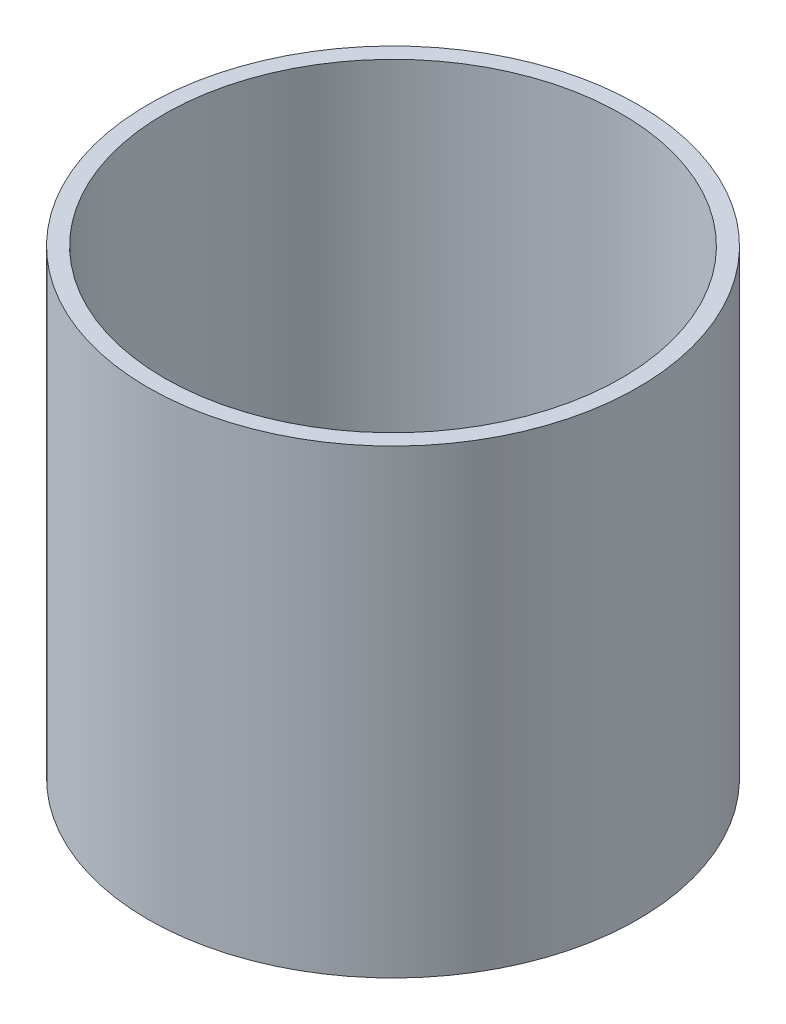
ISO-10303-21;
HEADER;
FILE_DESCRIPTION(('STEP AP214'),'2;1');
FILE_NAME('part.step','',(''),(''),'','','');
FILE_SCHEMA(('AUTOMOTIVE_DESIGN { 1 0 10303 214 1 1 1 1 }'));
ENDSEC;
DATA;
#1=APPLICATION_CONTEXT('core data for automotive mechanical design processes');
#2=APPLICATION_PROTOCOL_DEFINITION('international standard','automotive_design',2000,#1);
#3=PRODUCT_CONTEXT('',#1,'mechanical');
#4=PRODUCT('Part','Part','',(#3));
#5=PRODUCT_RELATED_PRODUCT_CATEGORY('part','',(#4));
#6=PRODUCT_DEFINITION_FORMATION('','',#4);
#7=PRODUCT_DEFINITION_CONTEXT('part definition',#1,'design');
#8=PRODUCT_DEFINITION('design','',#6,#7);
#9=PRODUCT_DEFINITION_SHAPE('','',#8);
#10=(LENGTH_UNIT() NAMED_UNIT(*) SI_UNIT(.MILLI.,.METRE.));
#11=(NAMED_UNIT(*) PLANE_ANGLE_UNIT() SI_UNIT($,.RADIAN.));
#12=(NAMED_UNIT(*) SI_UNIT($,.STERADIAN.) SOLID_ANGLE_UNIT());
#13=UNCERTAINTY_MEASURE_WITH_UNIT(LENGTH_MEASURE(1.E-05),#10,'distance_accuracy_value','');
#14=(GEOMETRIC_REPRESENTATION_CONTEXT(3) GLOBAL_UNCERTAINTY_ASSIGNED_CONTEXT((#13)) GLOBAL_UNIT_ASSIGNED_CONTEXT((#10,
#11,#12)) REPRESENTATION_CONTEXT('',''));
#15=CARTESIAN_POINT('',(0.,0.,0.));
#16=DIRECTION('',(0.,0.,1.));
#17=DIRECTION('',(1.,0.,0.));
#18=AXIS2_PLACEMENT_3D('',#15,#16,#17);
#19=CARTESIAN_POINT('',(0.,282.,0.));
#20=DIRECTION('',(0.,-1.,0.));
#21=DIRECTION('',(0.,0.,-1.));
#22=AXIS2_PLACEMENT_3D('',#19,#20,#21);
#23=CYLINDRICAL_SURFACE('',#22,150.);
#24=CARTESIAN_POINT('',(0.,282.,0.));
#25=DIRECTION('',(0.,1.,0.));
#26=DIRECTION('',(0.,0.,1.));
#27=AXIS2_PLACEMENT_3D('',#24,#25,#26);
#28=CIRCLE('',#27,150.);
#29=CARTESIAN_POINT('',(0.,282.,150.));
#30=VERTEX_POINT('',#29);
#31=EDGE_CURVE('E40',#30,#30,#28,.T.);
#32=ORIENTED_EDGE('',*,*,#31,.F.);
#33=EDGE_LOOP('',(#32));
#34=FACE_BOUND('',#33,.T.);
#35=CARTESIAN_POINT('',(0.,0.,0.));
#36=DIRECTION('',(0.,1.,0.));
#37=DIRECTION('',(0.,0.,1.));
#38=AXIS2_PLACEMENT_3D('',#35,#36,#37);
#39=CIRCLE('',#38,150.);
#40=CARTESIAN_POINT('',(0.,0.,150.));
#41=VERTEX_POINT('',#40);
#42=EDGE_CURVE('E46',#41,#41,#39,.T.);
#43=ORIENTED_EDGE('',*,*,#42,.T.);
#44=EDGE_LOOP('',(#43));
#45=FACE_BOUND('',#44,.T.);
#46=ADVANCED_FACE('F33',(#34,#45),#23,.T.);
#47=CARTESIAN_POINT('',(0.,282.,0.));
#48=DIRECTION('',(0.,-1.,0.));
#49=DIRECTION('',(0.,0.,-1.));
#50=AXIS2_PLACEMENT_3D('',#47,#48,#49);
#51=CYLINDRICAL_SURFACE('',#50,140.);
#52=CARTESIAN_POINT('',(0.,282.,0.));
#53=DIRECTION('',(0.,1.,0.));
#54=DIRECTION('',(0.,0.,1.));
#55=AXIS2_PLACEMENT_3D('',#52,#53,#54);
#56=CIRCLE('',#55,140.);
#57=CARTESIAN_POINT('',(0.,282.,140.));
#58=VERTEX_POINT('',#57);
#59=EDGE_CURVE('E10',#58,#58,#56,.T.);
#60=ORIENTED_EDGE('',*,*,#59,.T.);
#61=EDGE_LOOP('',(#60));
#62=FACE_BOUND('',#61,.T.);
#63=CARTESIAN_POINT('',(0.,0.,0.));
#64=DIRECTION('',(0.,1.,0.));
#65=DIRECTION('',(0.,0.,1.));
#66=AXIS2_PLACEMENT_3D('',#63,#64,#65);
#67=CIRCLE('',#66,140.);
#68=CARTESIAN_POINT('',(0.,0.,140.));
#69=VERTEX_POINT('',#68);
#70=EDGE_CURVE('E36',#69,#69,#67,.T.);
#71=ORIENTED_EDGE('',*,*,#70,.F.);
#72=EDGE_LOOP('',(#71));
#73=FACE_BOUND('',#72,.T.);
#74=ADVANCED_FACE('F55',(#62,#73),#51,.F.);
#75=CARTESIAN_POINT('',(0.,282.,0.));
#76=DIRECTION('',(0.,1.,0.));
#77=DIRECTION('',(0.,0.,1.));
#78=AXIS2_PLACEMENT_3D('',#75,#76,#77);
#79=PLANE('',#78);
#80=ORIENTED_EDGE('',*,*,#31,.T.);
#81=EDGE_LOOP('',(#80));
#82=FACE_BOUND('',#81,.T.);
#83=ORIENTED_EDGE('',*,*,#59,.F.);
#84=EDGE_LOOP('',(#83));
#85=FACE_BOUND('',#84,.T.);
#86=ADVANCED_FACE('F57',(#82,#85),#79,.T.);
#87=CARTESIAN_POINT('',(0.,0.,0.));
#88=DIRECTION('',(0.,1.,0.));
#89=DIRECTION('',(0.,0.,1.));
#90=AXIS2_PLACEMENT_3D('',#87,#88,#89);
#91=PLANE('',#90);
#92=ORIENTED_EDGE('',*,*,#42,.F.);
#93=EDGE_LOOP('',(#92));
#94=FACE_BOUND('',#93,.T.);
#95=ORIENTED_EDGE('',*,*,#70,.T.);
#96=EDGE_LOOP('',(#95));
#97=FACE_BOUND('',#96,.T.);
#98=ADVANCED_FACE('F53',(#94,#97),#91,.F.);
#99=CLOSED_SHELL('',(#46,#74,#86,#98));
#100=MANIFOLD_SOLID_BREP('B2',#99);
#101=ADVANCED_BREP_SHAPE_REPRESENTATION('',(#18,#100),#14);
#102=SHAPE_DEFINITION_REPRESENTATION(#9,#101);
ENDSEC;
END-ISO-10303-21;
